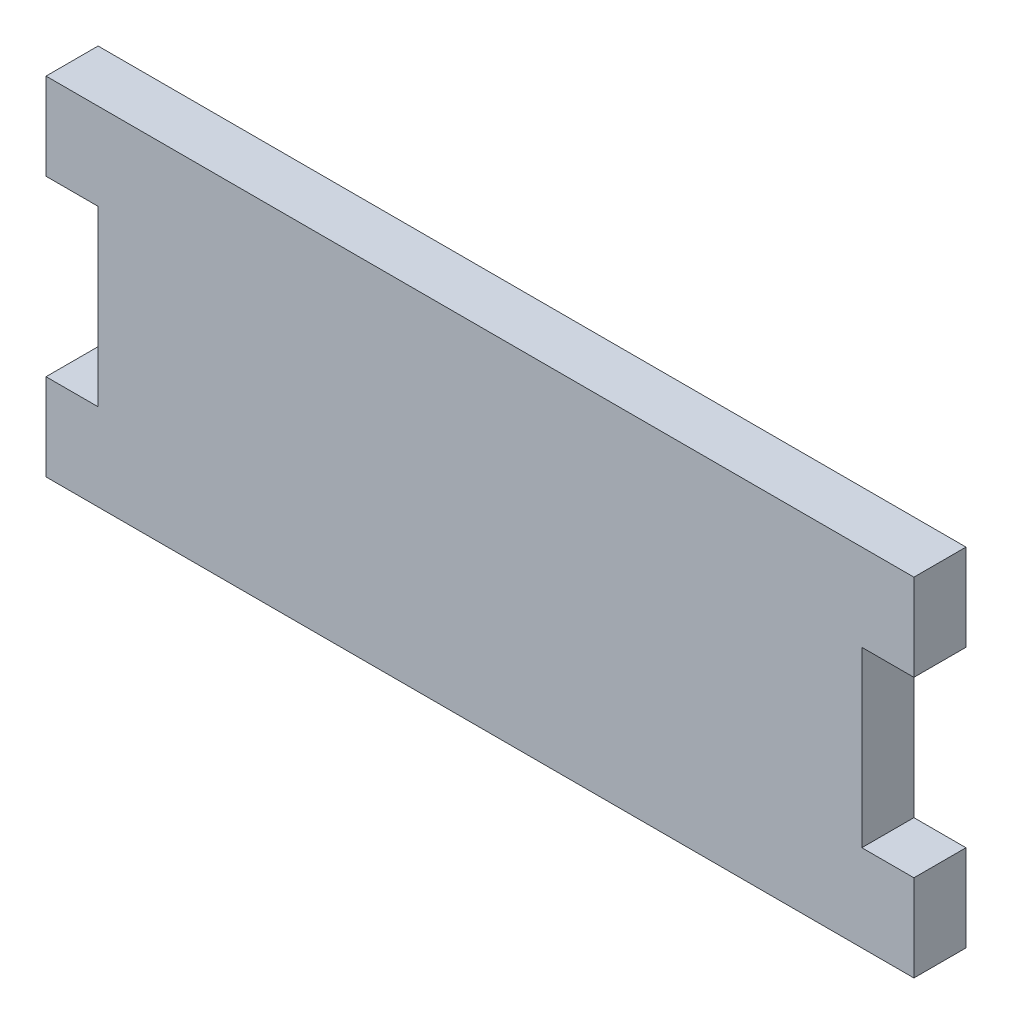
ISO-10303-21;
HEADER;
FILE_DESCRIPTION(('STEP AP214'),'2;1');
FILE_NAME('part.step','',(''),(''),'','','');
FILE_SCHEMA(('AUTOMOTIVE_DESIGN { 1 0 10303 214 1 1 1 1 }'));
ENDSEC;
DATA;
#1=APPLICATION_CONTEXT('core data for automotive mechanical design processes');
#2=APPLICATION_PROTOCOL_DEFINITION('international standard','automotive_design',2000,#1);
#3=PRODUCT_CONTEXT('',#1,'mechanical');
#4=PRODUCT('Part','Part','',(#3));
#5=PRODUCT_RELATED_PRODUCT_CATEGORY('part','',(#4));
#6=PRODUCT_DEFINITION_FORMATION('','',#4);
#7=PRODUCT_DEFINITION_CONTEXT('part definition',#1,'design');
#8=PRODUCT_DEFINITION('design','',#6,#7);
#9=PRODUCT_DEFINITION_SHAPE('','',#8);
#10=(LENGTH_UNIT() NAMED_UNIT(*) SI_UNIT(.MILLI.,.METRE.));
#11=(NAMED_UNIT(*) PLANE_ANGLE_UNIT() SI_UNIT($,.RADIAN.));
#12=(NAMED_UNIT(*) SI_UNIT($,.STERADIAN.) SOLID_ANGLE_UNIT());
#13=UNCERTAINTY_MEASURE_WITH_UNIT(LENGTH_MEASURE(1.E-05),#10,'distance_accuracy_value','');
#14=(GEOMETRIC_REPRESENTATION_CONTEXT(3) GLOBAL_UNCERTAINTY_ASSIGNED_CONTEXT((#13)) GLOBAL_UNIT_ASSIGNED_CONTEXT((#10,
#11,#12)) REPRESENTATION_CONTEXT('',''));
#15=CARTESIAN_POINT('',(0.,0.,0.));
#16=DIRECTION('',(0.,0.,1.));
#17=DIRECTION('',(1.,0.,0.));
#18=AXIS2_PLACEMENT_3D('',#15,#16,#17);
#19=CARTESIAN_POINT('',(-3.73843200000002,18.564832,3.));
#20=DIRECTION('',(0.,1.,0.));
#21=DIRECTION('',(0.,0.,1.));
#22=AXIS2_PLACEMENT_3D('',#19,#20,#21);
#23=PLANE('',#22);
#24=DIRECTION('',(1.,0.,0.));
#25=VECTOR('',#24,1.);
#26=CARTESIAN_POINT('',(-3.73843200000002,18.564832,0.));
#27=LINE('',#26,#25);
#28=CARTESIAN_POINT('',(-3.73843200000002,18.564832,0.));
#29=VERTEX_POINT('',#28);
#30=CARTESIAN_POINT('',(-0.738432000000017,18.564832,0.));
#31=VERTEX_POINT('',#30);
#32=EDGE_CURVE('E156',#29,#31,#27,.T.);
#33=ORIENTED_EDGE('',*,*,#32,.T.);
#34=DIRECTION('',(0.,0.,-1.));
#35=VECTOR('',#34,1.);
#36=CARTESIAN_POINT('',(-0.738432000000017,18.564832,3.));
#37=LINE('',#36,#35);
#38=CARTESIAN_POINT('',(-0.738432000000017,18.564832,3.));
#39=VERTEX_POINT('',#38);
#40=EDGE_CURVE('E11',#39,#31,#37,.T.);
#41=ORIENTED_EDGE('',*,*,#40,.F.);
#42=DIRECTION('',(1.,0.,0.));
#43=VECTOR('',#42,1.);
#44=CARTESIAN_POINT('',(-3.73843200000002,18.564832,3.));
#45=LINE('',#44,#43);
#46=CARTESIAN_POINT('',(-3.73843200000002,18.564832,3.));
#47=VERTEX_POINT('',#46);
#48=EDGE_CURVE('E186',#47,#39,#45,.T.);
#49=ORIENTED_EDGE('',*,*,#48,.F.);
#50=DIRECTION('',(0.,0.,-1.));
#51=VECTOR('',#50,1.);
#52=CARTESIAN_POINT('',(-3.73843200000002,18.564832,3.));
#53=LINE('',#52,#51);
#54=EDGE_CURVE('E51',#47,#29,#53,.T.);
#55=ORIENTED_EDGE('',*,*,#54,.T.);
#56=EDGE_LOOP('',(#33,#41,#49,#55));
#57=FACE_BOUND('',#56,.T.);
#58=ADVANCED_FACE('F35',(#57),#23,.F.);
#59=CARTESIAN_POINT('',(-0.738432000000017,18.564832,3.));
#60=DIRECTION('',(1.,0.,0.));
#61=DIRECTION('',(0.,0.,-1.));
#62=AXIS2_PLACEMENT_3D('',#59,#60,#61);
#63=PLANE('',#62);
#64=DIRECTION('',(0.,-1.,0.));
#65=VECTOR('',#64,1.);
#66=CARTESIAN_POINT('',(-0.738432000000017,18.564832,0.));
#67=LINE('',#66,#65);
#68=CARTESIAN_POINT('',(-0.738432000000017,8.564832,0.));
#69=VERTEX_POINT('',#68);
#70=EDGE_CURVE('E158',#31,#69,#67,.T.);
#71=ORIENTED_EDGE('',*,*,#70,.T.);
#72=DIRECTION('',(0.,0.,-1.));
#73=VECTOR('',#72,1.);
#74=CARTESIAN_POINT('',(-0.738432000000017,8.564832,3.));
#75=LINE('',#74,#73);
#76=CARTESIAN_POINT('',(-0.738432000000017,8.564832,3.));
#77=VERTEX_POINT('',#76);
#78=EDGE_CURVE('E43',#77,#69,#75,.T.);
#79=ORIENTED_EDGE('',*,*,#78,.F.);
#80=DIRECTION('',(0.,-1.,0.));
#81=VECTOR('',#80,1.);
#82=CARTESIAN_POINT('',(-0.738432000000017,18.564832,3.));
#83=LINE('',#82,#81);
#84=EDGE_CURVE('E102',#39,#77,#83,.T.);
#85=ORIENTED_EDGE('',*,*,#84,.F.);
#86=ORIENTED_EDGE('',*,*,#40,.T.);
#87=EDGE_LOOP('',(#71,#79,#85,#86));
#88=FACE_BOUND('',#87,.T.);
#89=ADVANCED_FACE('F249',(#88),#63,.F.);
#90=CARTESIAN_POINT('',(-0.738432000000017,8.564832,3.));
#91=DIRECTION('',(0.,-1.,0.));
#92=DIRECTION('',(1.,0.,0.));
#93=AXIS2_PLACEMENT_3D('',#90,#91,#92);
#94=PLANE('',#93);
#95=DIRECTION('',(-1.,0.,0.));
#96=VECTOR('',#95,1.);
#97=CARTESIAN_POINT('',(-0.738432000000017,8.564832,0.));
#98=LINE('',#97,#96);
#99=CARTESIAN_POINT('',(-3.73843200000002,8.56483200000002,0.));
#100=VERTEX_POINT('',#99);
#101=EDGE_CURVE('E160',#69,#100,#98,.T.);
#102=ORIENTED_EDGE('',*,*,#101,.T.);
#103=DIRECTION('',(0.,0.,-1.));
#104=VECTOR('',#103,1.);
#105=CARTESIAN_POINT('',(-3.73843200000002,8.56483200000002,3.));
#106=LINE('',#105,#104);
#107=CARTESIAN_POINT('',(-3.73843200000002,8.56483200000002,3.));
#108=VERTEX_POINT('',#107);
#109=EDGE_CURVE('E200',#108,#100,#106,.T.);
#110=ORIENTED_EDGE('',*,*,#109,.F.);
#111=DIRECTION('',(-1.,0.,0.));
#112=VECTOR('',#111,1.);
#113=CARTESIAN_POINT('',(-0.738432000000017,8.564832,3.));
#114=LINE('',#113,#112);
#115=EDGE_CURVE('E208',#77,#108,#114,.T.);
#116=ORIENTED_EDGE('',*,*,#115,.F.);
#117=ORIENTED_EDGE('',*,*,#78,.T.);
#118=EDGE_LOOP('',(#102,#110,#116,#117));
#119=FACE_BOUND('',#118,.T.);
#120=ADVANCED_FACE('F206',(#119),#94,.F.);
#121=CARTESIAN_POINT('',(-3.73843200000002,8.56483200000002,3.));
#122=DIRECTION('',(1.,0.,0.));
#123=DIRECTION('',(0.,0.,-1.));
#124=AXIS2_PLACEMENT_3D('',#121,#122,#123);
#125=PLANE('',#124);
#126=DIRECTION('',(0.,-1.,0.));
#127=VECTOR('',#126,1.);
#128=CARTESIAN_POINT('',(-3.73843200000002,8.56483200000002,0.));
#129=LINE('',#128,#127);
#130=CARTESIAN_POINT('',(-3.73843200000002,3.564832,0.));
#131=VERTEX_POINT('',#130);
#132=EDGE_CURVE('E162',#100,#131,#129,.T.);
#133=ORIENTED_EDGE('',*,*,#132,.T.);
#134=DIRECTION('',(0.,0.,-1.));
#135=VECTOR('',#134,1.);
#136=CARTESIAN_POINT('',(-3.73843200000002,3.564832,3.));
#137=LINE('',#136,#135);
#138=CARTESIAN_POINT('',(-3.73843200000002,3.564832,3.));
#139=VERTEX_POINT('',#138);
#140=EDGE_CURVE('E198',#139,#131,#137,.T.);
#141=ORIENTED_EDGE('',*,*,#140,.F.);
#142=DIRECTION('',(0.,-1.,0.));
#143=VECTOR('',#142,1.);
#144=CARTESIAN_POINT('',(-3.73843200000002,8.56483200000002,3.));
#145=LINE('',#144,#143);
#146=EDGE_CURVE('E218',#108,#139,#145,.T.);
#147=ORIENTED_EDGE('',*,*,#146,.F.);
#148=ORIENTED_EDGE('',*,*,#109,.T.);
#149=EDGE_LOOP('',(#133,#141,#147,#148));
#150=FACE_BOUND('',#149,.T.);
#151=ADVANCED_FACE('F215',(#150),#125,.F.);
#152=CARTESIAN_POINT('',(46.261568,3.564832,3.));
#153=DIRECTION('',(0.,-1.,0.));
#154=DIRECTION('',(0.,0.,-1.));
#155=AXIS2_PLACEMENT_3D('',#152,#153,#154);
#156=PLANE('',#155);
#157=DIRECTION('',(-1.,0.,0.));
#158=VECTOR('',#157,1.);
#159=CARTESIAN_POINT('',(46.261568,3.564832,0.));
#160=LINE('',#159,#158);
#161=CARTESIAN_POINT('',(46.261568,3.564832,0.));
#162=VERTEX_POINT('',#161);
#163=EDGE_CURVE('E165',#162,#131,#160,.T.);
#164=ORIENTED_EDGE('',*,*,#163,.F.);
#165=DIRECTION('',(0.,0.,-1.));
#166=VECTOR('',#165,1.);
#167=CARTESIAN_POINT('',(46.261568,3.564832,3.));
#168=LINE('',#167,#166);
#169=CARTESIAN_POINT('',(46.261568,3.564832,3.));
#170=VERTEX_POINT('',#169);
#171=EDGE_CURVE('E196',#170,#162,#168,.T.);
#172=ORIENTED_EDGE('',*,*,#171,.F.);
#173=DIRECTION('',(-1.,0.,0.));
#174=VECTOR('',#173,1.);
#175=CARTESIAN_POINT('',(46.261568,3.564832,3.));
#176=LINE('',#175,#174);
#177=EDGE_CURVE('E220',#170,#139,#176,.T.);
#178=ORIENTED_EDGE('',*,*,#177,.T.);
#179=ORIENTED_EDGE('',*,*,#140,.T.);
#180=EDGE_LOOP('',(#164,#172,#178,#179));
#181=FACE_BOUND('',#180,.T.);
#182=ADVANCED_FACE('F262',(#181),#156,.T.);
#183=CARTESIAN_POINT('',(46.261568,8.564832,3.));
#184=DIRECTION('',(1.,0.,0.));
#185=DIRECTION('',(0.,1.,0.));
#186=AXIS2_PLACEMENT_3D('',#183,#184,#185);
#187=PLANE('',#186);
#188=DIRECTION('',(0.,-1.,0.));
#189=VECTOR('',#188,1.);
#190=CARTESIAN_POINT('',(46.261568,8.564832,0.));
#191=LINE('',#190,#189);
#192=CARTESIAN_POINT('',(46.261568,8.564832,0.));
#193=VERTEX_POINT('',#192);
#194=EDGE_CURVE('E168',#193,#162,#191,.T.);
#195=ORIENTED_EDGE('',*,*,#194,.F.);
#196=DIRECTION('',(0.,0.,-1.));
#197=VECTOR('',#196,1.);
#198=CARTESIAN_POINT('',(46.261568,8.564832,3.));
#199=LINE('',#198,#197);
#200=CARTESIAN_POINT('',(46.261568,8.564832,3.));
#201=VERTEX_POINT('',#200);
#202=EDGE_CURVE('E194',#201,#193,#199,.T.);
#203=ORIENTED_EDGE('',*,*,#202,.F.);
#204=DIRECTION('',(0.,-1.,0.));
#205=VECTOR('',#204,1.);
#206=CARTESIAN_POINT('',(46.261568,8.564832,3.));
#207=LINE('',#206,#205);
#208=EDGE_CURVE('E222',#201,#170,#207,.T.);
#209=ORIENTED_EDGE('',*,*,#208,.T.);
#210=ORIENTED_EDGE('',*,*,#171,.T.);
#211=EDGE_LOOP('',(#195,#203,#209,#210));
#212=FACE_BOUND('',#211,.T.);
#213=ADVANCED_FACE('F265',(#212),#187,.T.);
#214=CARTESIAN_POINT('',(43.261568,8.564832,3.));
#215=DIRECTION('',(0.,1.,0.));
#216=DIRECTION('',(0.,0.,1.));
#217=AXIS2_PLACEMENT_3D('',#214,#215,#216);
#218=PLANE('',#217);
#219=DIRECTION('',(1.,0.,0.));
#220=VECTOR('',#219,1.);
#221=CARTESIAN_POINT('',(43.261568,8.564832,0.));
#222=LINE('',#221,#220);
#223=CARTESIAN_POINT('',(43.261568,8.564832,0.));
#224=VERTEX_POINT('',#223);
#225=EDGE_CURVE('E171',#224,#193,#222,.T.);
#226=ORIENTED_EDGE('',*,*,#225,.F.);
#227=DIRECTION('',(0.,0.,-1.));
#228=VECTOR('',#227,1.);
#229=CARTESIAN_POINT('',(43.261568,8.564832,3.));
#230=LINE('',#229,#228);
#231=CARTESIAN_POINT('',(43.261568,8.564832,3.));
#232=VERTEX_POINT('',#231);
#233=EDGE_CURVE('E192',#232,#224,#230,.T.);
#234=ORIENTED_EDGE('',*,*,#233,.F.);
#235=DIRECTION('',(1.,0.,0.));
#236=VECTOR('',#235,1.);
#237=CARTESIAN_POINT('',(43.261568,8.564832,3.));
#238=LINE('',#237,#236);
#239=EDGE_CURVE('E229',#232,#201,#238,.T.);
#240=ORIENTED_EDGE('',*,*,#239,.T.);
#241=ORIENTED_EDGE('',*,*,#202,.T.);
#242=EDGE_LOOP('',(#226,#234,#240,#241));
#243=FACE_BOUND('',#242,.T.);
#244=ADVANCED_FACE('F269',(#243),#218,.T.);
#245=CARTESIAN_POINT('',(43.261568,18.564832,3.));
#246=DIRECTION('',(1.,0.,0.));
#247=DIRECTION('',(0.,0.,-1.));
#248=AXIS2_PLACEMENT_3D('',#245,#246,#247);
#249=PLANE('',#248);
#250=DIRECTION('',(0.,-1.,0.));
#251=VECTOR('',#250,1.);
#252=CARTESIAN_POINT('',(43.261568,18.564832,0.));
#253=LINE('',#252,#251);
#254=CARTESIAN_POINT('',(43.261568,18.564832,0.));
#255=VERTEX_POINT('',#254);
#256=EDGE_CURVE('E174',#255,#224,#253,.T.);
#257=ORIENTED_EDGE('',*,*,#256,.F.);
#258=DIRECTION('',(0.,0.,-1.));
#259=VECTOR('',#258,1.);
#260=CARTESIAN_POINT('',(43.261568,18.564832,3.));
#261=LINE('',#260,#259);
#262=CARTESIAN_POINT('',(43.261568,18.564832,3.));
#263=VERTEX_POINT('',#262);
#264=EDGE_CURVE('E190',#263,#255,#261,.T.);
#265=ORIENTED_EDGE('',*,*,#264,.F.);
#266=DIRECTION('',(0.,-1.,0.));
#267=VECTOR('',#266,1.);
#268=CARTESIAN_POINT('',(43.261568,18.564832,3.));
#269=LINE('',#268,#267);
#270=EDGE_CURVE('E232',#263,#232,#269,.T.);
#271=ORIENTED_EDGE('',*,*,#270,.T.);
#272=ORIENTED_EDGE('',*,*,#233,.T.);
#273=EDGE_LOOP('',(#257,#265,#271,#272));
#274=FACE_BOUND('',#273,.T.);
#275=ADVANCED_FACE('F273',(#274),#249,.T.);
#276=CARTESIAN_POINT('',(46.261568,18.564832,3.));
#277=DIRECTION('',(0.,-1.,0.));
#278=DIRECTION('',(0.,0.,-1.));
#279=AXIS2_PLACEMENT_3D('',#276,#277,#278);
#280=PLANE('',#279);
#281=DIRECTION('',(-1.,0.,0.));
#282=VECTOR('',#281,1.);
#283=CARTESIAN_POINT('',(46.261568,18.564832,0.));
#284=LINE('',#283,#282);
#285=CARTESIAN_POINT('',(46.261568,18.564832,0.));
#286=VERTEX_POINT('',#285);
#287=EDGE_CURVE('E177',#286,#255,#284,.T.);
#288=ORIENTED_EDGE('',*,*,#287,.F.);
#289=DIRECTION('',(0.,0.,-1.));
#290=VECTOR('',#289,1.);
#291=CARTESIAN_POINT('',(46.261568,18.564832,3.));
#292=LINE('',#291,#290);
#293=CARTESIAN_POINT('',(46.261568,18.564832,3.));
#294=VERTEX_POINT('',#293);
#295=EDGE_CURVE('E148',#294,#286,#292,.T.);
#296=ORIENTED_EDGE('',*,*,#295,.F.);
#297=DIRECTION('',(-1.,0.,0.));
#298=VECTOR('',#297,1.);
#299=CARTESIAN_POINT('',(46.261568,18.564832,3.));
#300=LINE('',#299,#298);
#301=EDGE_CURVE('E138',#294,#263,#300,.T.);
#302=ORIENTED_EDGE('',*,*,#301,.T.);
#303=ORIENTED_EDGE('',*,*,#264,.T.);
#304=EDGE_LOOP('',(#288,#296,#302,#303));
#305=FACE_BOUND('',#304,.T.);
#306=ADVANCED_FACE('F236',(#305),#280,.T.);
#307=CARTESIAN_POINT('',(46.261568,18.564832,3.));
#308=DIRECTION('',(-1.,0.,0.));
#309=DIRECTION('',(0.,0.,1.));
#310=AXIS2_PLACEMENT_3D('',#307,#308,#309);
#311=PLANE('',#310);
#312=DIRECTION('',(0.,1.,0.));
#313=VECTOR('',#312,1.);
#314=CARTESIAN_POINT('',(46.261568,18.564832,0.));
#315=LINE('',#314,#313);
#316=CARTESIAN_POINT('',(46.261568,23.564832,0.));
#317=VERTEX_POINT('',#316);
#318=EDGE_CURVE('E145',#286,#317,#315,.T.);
#319=ORIENTED_EDGE('',*,*,#318,.T.);
#320=DIRECTION('',(0.,0.,-1.));
#321=VECTOR('',#320,1.);
#322=CARTESIAN_POINT('',(46.261568,23.564832,3.));
#323=LINE('',#322,#321);
#324=CARTESIAN_POINT('',(46.261568,23.564832,3.));
#325=VERTEX_POINT('',#324);
#326=EDGE_CURVE('E142',#325,#317,#323,.T.);
#327=ORIENTED_EDGE('',*,*,#326,.F.);
#328=DIRECTION('',(0.,1.,0.));
#329=VECTOR('',#328,1.);
#330=CARTESIAN_POINT('',(46.261568,18.564832,3.));
#331=LINE('',#330,#329);
#332=EDGE_CURVE('E130',#294,#325,#331,.T.);
#333=ORIENTED_EDGE('',*,*,#332,.F.);
#334=ORIENTED_EDGE('',*,*,#295,.T.);
#335=EDGE_LOOP('',(#319,#327,#333,#334));
#336=FACE_BOUND('',#335,.T.);
#337=ADVANCED_FACE('F143',(#336),#311,.F.);
#338=CARTESIAN_POINT('',(46.261568,23.564832,3.));
#339=DIRECTION('',(0.,-1.,0.));
#340=DIRECTION('',(0.,0.,-1.));
#341=AXIS2_PLACEMENT_3D('',#338,#339,#340);
#342=PLANE('',#341);
#343=DIRECTION('',(-1.,0.,0.));
#344=VECTOR('',#343,1.);
#345=CARTESIAN_POINT('',(46.261568,23.564832,0.));
#346=LINE('',#345,#344);
#347=CARTESIAN_POINT('',(-3.73843200000002,23.564832,0.));
#348=VERTEX_POINT('',#347);
#349=EDGE_CURVE('E181',#317,#348,#346,.T.);
#350=ORIENTED_EDGE('',*,*,#349,.T.);
#351=DIRECTION('',(0.,0.,-1.));
#352=VECTOR('',#351,1.);
#353=CARTESIAN_POINT('',(-3.73843200000002,23.564832,3.));
#354=LINE('',#353,#352);
#355=CARTESIAN_POINT('',(-3.73843200000002,23.564832,3.));
#356=VERTEX_POINT('',#355);
#357=EDGE_CURVE('E90',#356,#348,#354,.T.);
#358=ORIENTED_EDGE('',*,*,#357,.F.);
#359=DIRECTION('',(-1.,0.,0.));
#360=VECTOR('',#359,1.);
#361=CARTESIAN_POINT('',(46.261568,23.564832,3.));
#362=LINE('',#361,#360);
#363=EDGE_CURVE('E135',#325,#356,#362,.T.);
#364=ORIENTED_EDGE('',*,*,#363,.F.);
#365=ORIENTED_EDGE('',*,*,#326,.T.);
#366=EDGE_LOOP('',(#350,#358,#364,#365));
#367=FACE_BOUND('',#366,.T.);
#368=ADVANCED_FACE('F150',(#367),#342,.F.);
#369=CARTESIAN_POINT('',(-3.73843200000002,18.564832,3.));
#370=DIRECTION('',(-1.,0.,0.));
#371=DIRECTION('',(0.,0.,1.));
#372=AXIS2_PLACEMENT_3D('',#369,#370,#371);
#373=PLANE('',#372);
#374=DIRECTION('',(0.,1.,0.));
#375=VECTOR('',#374,1.);
#376=CARTESIAN_POINT('',(-3.73843200000002,18.564832,0.));
#377=LINE('',#376,#375);
#378=EDGE_CURVE('E183',#29,#348,#377,.T.);
#379=ORIENTED_EDGE('',*,*,#378,.F.);
#380=ORIENTED_EDGE('',*,*,#54,.F.);
#381=DIRECTION('',(0.,1.,0.));
#382=VECTOR('',#381,1.);
#383=CARTESIAN_POINT('',(-3.73843200000002,18.564832,3.));
#384=LINE('',#383,#382);
#385=EDGE_CURVE('E151',#47,#356,#384,.T.);
#386=ORIENTED_EDGE('',*,*,#385,.T.);
#387=ORIENTED_EDGE('',*,*,#357,.T.);
#388=EDGE_LOOP('',(#379,#380,#386,#387));
#389=FACE_BOUND('',#388,.T.);
#390=ADVANCED_FACE('F238',(#389),#373,.T.);
#391=CARTESIAN_POINT('',(0.,0.,3.));
#392=DIRECTION('',(0.,0.,-1.));
#393=DIRECTION('',(-1.,0.,0.));
#394=AXIS2_PLACEMENT_3D('',#391,#392,#393);
#395=PLANE('',#394);
#396=ORIENTED_EDGE('',*,*,#48,.T.);
#397=ORIENTED_EDGE('',*,*,#84,.T.);
#398=ORIENTED_EDGE('',*,*,#115,.T.);
#399=ORIENTED_EDGE('',*,*,#146,.T.);
#400=ORIENTED_EDGE('',*,*,#177,.F.);
#401=ORIENTED_EDGE('',*,*,#208,.F.);
#402=ORIENTED_EDGE('',*,*,#239,.F.);
#403=ORIENTED_EDGE('',*,*,#270,.F.);
#404=ORIENTED_EDGE('',*,*,#301,.F.);
#405=ORIENTED_EDGE('',*,*,#332,.T.);
#406=ORIENTED_EDGE('',*,*,#363,.T.);
#407=ORIENTED_EDGE('',*,*,#385,.F.);
#408=EDGE_LOOP('',(#396,#397,#398,#399,#400,#401,#402,#403,#404,#405,#406,#407));
#409=FACE_BOUND('',#408,.T.);
#410=ADVANCED_FACE('F132',(#409),#395,.F.);
#411=CARTESIAN_POINT('',(0.,0.,0.));
#412=DIRECTION('',(0.,0.,-1.));
#413=DIRECTION('',(-1.,0.,0.));
#414=AXIS2_PLACEMENT_3D('',#411,#412,#413);
#415=PLANE('',#414);
#416=ORIENTED_EDGE('',*,*,#32,.F.);
#417=ORIENTED_EDGE('',*,*,#378,.T.);
#418=ORIENTED_EDGE('',*,*,#349,.F.);
#419=ORIENTED_EDGE('',*,*,#318,.F.);
#420=ORIENTED_EDGE('',*,*,#287,.T.);
#421=ORIENTED_EDGE('',*,*,#256,.T.);
#422=ORIENTED_EDGE('',*,*,#225,.T.);
#423=ORIENTED_EDGE('',*,*,#194,.T.);
#424=ORIENTED_EDGE('',*,*,#163,.T.);
#425=ORIENTED_EDGE('',*,*,#132,.F.);
#426=ORIENTED_EDGE('',*,*,#101,.F.);
#427=ORIENTED_EDGE('',*,*,#70,.F.);
#428=EDGE_LOOP('',(#416,#417,#418,#419,#420,#421,#422,#423,#424,#425,#426,#427));
#429=FACE_BOUND('',#428,.T.);
#430=ADVANCED_FACE('F211',(#429),#415,.T.);
#431=CLOSED_SHELL('',(#58,#89,#120,#151,#182,#213,#244,#275,#306,#337,#368,#390,#410,#430));
#432=MANIFOLD_SOLID_BREP('B2',#431);
#433=ADVANCED_BREP_SHAPE_REPRESENTATION('',(#18,#432),#14);
#434=SHAPE_DEFINITION_REPRESENTATION(#9,#433);
ENDSEC;
END-ISO-10303-21;
